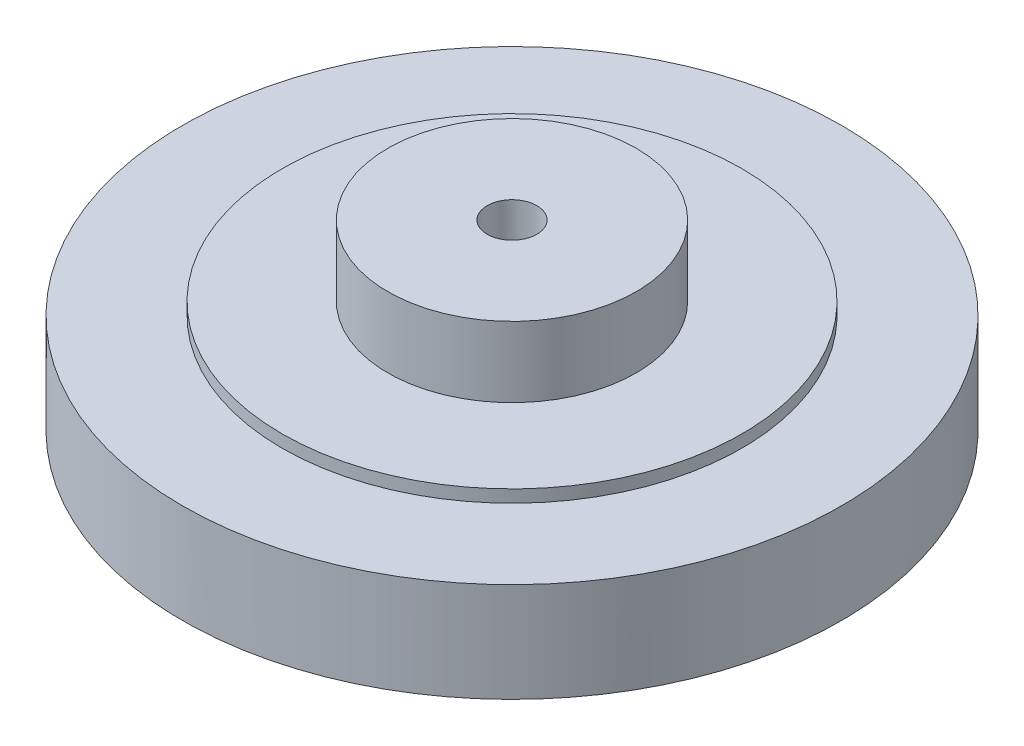
ISO-10303-21;
HEADER;
FILE_DESCRIPTION(('STEP AP214'),'2;1');
FILE_NAME('part.step','',(''),(''),'','','');
FILE_SCHEMA(('AUTOMOTIVE_DESIGN { 1 0 10303 214 1 1 1 1 }'));
ENDSEC;
DATA;
#1=APPLICATION_CONTEXT('core data for automotive mechanical design processes');
#2=APPLICATION_PROTOCOL_DEFINITION('international standard','automotive_design',2000,#1);
#3=PRODUCT_CONTEXT('',#1,'mechanical');
#4=PRODUCT('Part','Part','',(#3));
#5=PRODUCT_RELATED_PRODUCT_CATEGORY('part','',(#4));
#6=PRODUCT_DEFINITION_FORMATION('','',#4);
#7=PRODUCT_DEFINITION_CONTEXT('part definition',#1,'design');
#8=PRODUCT_DEFINITION('design','',#6,#7);
#9=PRODUCT_DEFINITION_SHAPE('','',#8);
#10=(LENGTH_UNIT() NAMED_UNIT(*) SI_UNIT(.MILLI.,.METRE.));
#11=(NAMED_UNIT(*) PLANE_ANGLE_UNIT() SI_UNIT($,.RADIAN.));
#12=(NAMED_UNIT(*) SI_UNIT($,.STERADIAN.) SOLID_ANGLE_UNIT());
#13=UNCERTAINTY_MEASURE_WITH_UNIT(LENGTH_MEASURE(1.E-05),#10,'distance_accuracy_value','');
#14=(GEOMETRIC_REPRESENTATION_CONTEXT(3) GLOBAL_UNCERTAINTY_ASSIGNED_CONTEXT((#13)) GLOBAL_UNIT_ASSIGNED_CONTEXT((#10,
#11,#12)) REPRESENTATION_CONTEXT('',''));
#15=CARTESIAN_POINT('',(0.,0.,0.));
#16=DIRECTION('',(0.,0.,1.));
#17=DIRECTION('',(1.,0.,0.));
#18=AXIS2_PLACEMENT_3D('',#15,#16,#17);
#19=CARTESIAN_POINT('',(0.,0.,0.));
#20=DIRECTION('',(0.,-1.,0.));
#21=DIRECTION('',(0.,0.,-1.));
#22=AXIS2_PLACEMENT_3D('',#19,#20,#21);
#23=CYLINDRICAL_SURFACE('',#22,27.75);
#24=CARTESIAN_POINT('',(0.,0.,0.));
#25=DIRECTION('',(0.,-1.,0.));
#26=DIRECTION('',(0.,0.,-1.));
#27=AXIS2_PLACEMENT_3D('',#24,#25,#26);
#28=CIRCLE('',#27,27.75);
#29=CARTESIAN_POINT('',(0.,0.,-27.75));
#30=VERTEX_POINT('',#29);
#31=EDGE_CURVE('E10',#30,#30,#28,.F.);
#32=ORIENTED_EDGE('',*,*,#31,.F.);
#33=EDGE_LOOP('',(#32));
#34=FACE_BOUND('',#33,.T.);
#35=CARTESIAN_POINT('',(0.,-1.5,0.));
#36=DIRECTION('',(0.,-1.,0.));
#37=DIRECTION('',(0.,0.,-1.));
#38=AXIS2_PLACEMENT_3D('',#35,#36,#37);
#39=CIRCLE('',#38,27.75);
#40=CARTESIAN_POINT('',(0.,-1.5,-27.75));
#41=VERTEX_POINT('',#40);
#42=EDGE_CURVE('E76',#41,#41,#39,.T.);
#43=ORIENTED_EDGE('',*,*,#42,.F.);
#44=EDGE_LOOP('',(#43));
#45=FACE_BOUND('',#44,.T.);
#46=ADVANCED_FACE('F47',(#34,#45),#23,.T.);
#47=CARTESIAN_POINT('',(0.,0.,0.));
#48=DIRECTION('',(0.,-1.,0.));
#49=DIRECTION('',(0.,0.,-1.));
#50=AXIS2_PLACEMENT_3D('',#47,#48,#49);
#51=CYLINDRICAL_SURFACE('',#50,15.);
#52=CARTESIAN_POINT('',(0.,22.,0.));
#53=DIRECTION('',(0.,-1.,0.));
#54=DIRECTION('',(0.,0.,-1.));
#55=AXIS2_PLACEMENT_3D('',#52,#53,#54);
#56=CIRCLE('',#55,15.);
#57=CARTESIAN_POINT('',(0.,22.,-15.));
#58=VERTEX_POINT('',#57);
#59=EDGE_CURVE('E60',#58,#58,#56,.T.);
#60=ORIENTED_EDGE('',*,*,#59,.T.);
#61=EDGE_LOOP('',(#60));
#62=FACE_BOUND('',#61,.T.);
#63=CARTESIAN_POINT('',(0.,13.5,0.));
#64=DIRECTION('',(0.,-1.,0.));
#65=DIRECTION('',(0.,0.,-1.));
#66=AXIS2_PLACEMENT_3D('',#63,#64,#65);
#67=CIRCLE('',#66,15.);
#68=CARTESIAN_POINT('',(0.,13.5,-15.));
#69=VERTEX_POINT('',#68);
#70=EDGE_CURVE('E71',#69,#69,#67,.F.);
#71=ORIENTED_EDGE('',*,*,#70,.T.);
#72=EDGE_LOOP('',(#71));
#73=FACE_BOUND('',#72,.T.);
#74=ADVANCED_FACE('F114',(#62,#73),#51,.T.);
#75=CARTESIAN_POINT('',(3.,22.,0.));
#76=DIRECTION('',(0.,1.,0.));
#77=DIRECTION('',(0.,0.,1.));
#78=AXIS2_PLACEMENT_3D('',#75,#76,#77);
#79=PLANE('',#78);
#80=CARTESIAN_POINT('',(0.,22.,0.));
#81=DIRECTION('',(0.,-1.,0.));
#82=DIRECTION('',(0.,0.,-1.));
#83=AXIS2_PLACEMENT_3D('',#80,#81,#82);
#84=CIRCLE('',#83,3.);
#85=CARTESIAN_POINT('',(0.,22.,-3.));
#86=VERTEX_POINT('',#85);
#87=EDGE_CURVE('E65',#86,#86,#84,.T.);
#88=ORIENTED_EDGE('',*,*,#87,.T.);
#89=EDGE_LOOP('',(#88));
#90=FACE_BOUND('',#89,.T.);
#91=ORIENTED_EDGE('',*,*,#59,.F.);
#92=EDGE_LOOP('',(#91));
#93=FACE_BOUND('',#92,.T.);
#94=ADVANCED_FACE('F49',(#90,#93),#79,.T.);
#95=CARTESIAN_POINT('',(0.,0.,0.));
#96=DIRECTION('',(0.,-1.,0.));
#97=DIRECTION('',(0.,0.,-1.));
#98=AXIS2_PLACEMENT_3D('',#95,#96,#97);
#99=CYLINDRICAL_SURFACE('',#98,3.);
#100=ORIENTED_EDGE('',*,*,#87,.F.);
#101=EDGE_LOOP('',(#100));
#102=FACE_BOUND('',#101,.T.);
#103=CARTESIAN_POINT('',(0.,-1.5,0.));
#104=DIRECTION('',(0.,-1.,0.));
#105=DIRECTION('',(0.,0.,-1.));
#106=AXIS2_PLACEMENT_3D('',#103,#104,#105);
#107=CIRCLE('',#106,3.);
#108=CARTESIAN_POINT('',(0.,-1.5,-3.));
#109=VERTEX_POINT('',#108);
#110=EDGE_CURVE('E80',#109,#109,#107,.T.);
#111=ORIENTED_EDGE('',*,*,#110,.T.);
#112=EDGE_LOOP('',(#111));
#113=FACE_BOUND('',#112,.T.);
#114=ADVANCED_FACE('F133',(#102,#113),#99,.F.);
#115=CARTESIAN_POINT('',(0.,-1.5,0.));
#116=DIRECTION('',(0.,-1.,0.));
#117=DIRECTION('',(0.,0.,-1.));
#118=AXIS2_PLACEMENT_3D('',#115,#116,#117);
#119=PLANE('',#118);
#120=ORIENTED_EDGE('',*,*,#110,.F.);
#121=EDGE_LOOP('',(#120));
#122=FACE_BOUND('',#121,.T.);
#123=ORIENTED_EDGE('',*,*,#42,.T.);
#124=EDGE_LOOP('',(#123));
#125=FACE_BOUND('',#124,.T.);
#126=ADVANCED_FACE('F126',(#122,#125),#119,.T.);
#127=CARTESIAN_POINT('',(0.,12.,0.));
#128=DIRECTION('',(0.,1.,0.));
#129=DIRECTION('',(0.,0.,1.));
#130=AXIS2_PLACEMENT_3D('',#127,#128,#129);
#131=CIRCLE('',#130,27.75);
#132=CARTESIAN_POINT('',(0.,12.,27.75));
#133=VERTEX_POINT('',#132);
#134=EDGE_CURVE('E55',#133,#133,#131,.F.);
#135=ORIENTED_EDGE('',*,*,#134,.F.);
#136=EDGE_LOOP('',(#135));
#137=FACE_BOUND('',#136,.T.);
#138=CARTESIAN_POINT('',(0.,13.5,0.));
#139=DIRECTION('',(0.,-1.,0.));
#140=DIRECTION('',(0.,0.,-1.));
#141=AXIS2_PLACEMENT_3D('',#138,#139,#140);
#142=CIRCLE('',#141,27.75);
#143=CARTESIAN_POINT('',(0.,13.5,-27.75));
#144=VERTEX_POINT('',#143);
#145=EDGE_CURVE('E75',#144,#144,#142,.T.);
#146=ORIENTED_EDGE('',*,*,#145,.T.);
#147=EDGE_LOOP('',(#146));
#148=FACE_BOUND('',#147,.T.);
#149=ADVANCED_FACE('F117',(#137,#148),#23,.T.);
#150=CARTESIAN_POINT('',(0.,13.5,0.));
#151=DIRECTION('',(0.,-1.,0.));
#152=DIRECTION('',(0.,0.,-1.));
#153=AXIS2_PLACEMENT_3D('',#150,#151,#152);
#154=PLANE('',#153);
#155=ORIENTED_EDGE('',*,*,#70,.F.);
#156=EDGE_LOOP('',(#155));
#157=FACE_BOUND('',#156,.T.);
#158=ORIENTED_EDGE('',*,*,#145,.F.);
#159=EDGE_LOOP('',(#158));
#160=FACE_BOUND('',#159,.T.);
#161=ADVANCED_FACE('F101',(#157,#160),#154,.F.);
#162=CARTESIAN_POINT('',(0.,124.539539519638,0.));
#163=DIRECTION('',(0.,-1.,0.));
#164=DIRECTION('',(0.,0.,-1.));
#165=AXIS2_PLACEMENT_3D('',#162,#163,#164);
#166=CYLINDRICAL_SURFACE('',#165,39.7887357729738);
#167=CARTESIAN_POINT('',(0.,0.,0.));
#168=DIRECTION('',(0.,-1.,0.));
#169=DIRECTION('',(0.,0.,-1.));
#170=AXIS2_PLACEMENT_3D('',#167,#168,#169);
#171=CIRCLE('',#170,39.7887357729738);
#172=CARTESIAN_POINT('',(0.,0.,-39.7887357729738));
#173=VERTEX_POINT('',#172);
#174=EDGE_CURVE('E87',#173,#173,#171,.T.);
#175=ORIENTED_EDGE('',*,*,#174,.F.);
#176=EDGE_LOOP('',(#175));
#177=FACE_BOUND('',#176,.T.);
#178=CARTESIAN_POINT('',(0.,12.,0.));
#179=DIRECTION('',(0.,1.,0.));
#180=DIRECTION('',(0.,0.,1.));
#181=AXIS2_PLACEMENT_3D('',#178,#179,#180);
#182=CIRCLE('',#181,39.7887357729738);
#183=CARTESIAN_POINT('',(0.,12.,39.7887357729738));
#184=VERTEX_POINT('',#183);
#185=EDGE_CURVE('E88',#184,#184,#182,.F.);
#186=ORIENTED_EDGE('',*,*,#185,.T.);
#187=EDGE_LOOP('',(#186));
#188=FACE_BOUND('',#187,.T.);
#189=ADVANCED_FACE('F98',(#177,#188),#166,.T.);
#190=CARTESIAN_POINT('',(0.,0.,0.));
#191=DIRECTION('',(0.,-1.,0.));
#192=DIRECTION('',(0.,0.,-1.));
#193=AXIS2_PLACEMENT_3D('',#190,#191,#192);
#194=PLANE('',#193);
#195=ORIENTED_EDGE('',*,*,#31,.T.);
#196=EDGE_LOOP('',(#195));
#197=FACE_BOUND('',#196,.T.);
#198=ORIENTED_EDGE('',*,*,#174,.T.);
#199=EDGE_LOOP('',(#198));
#200=FACE_BOUND('',#199,.T.);
#201=ADVANCED_FACE('F96',(#197,#200),#194,.T.);
#202=CARTESIAN_POINT('',(15.,12.,0.));
#203=DIRECTION('',(0.,1.,0.));
#204=DIRECTION('',(0.,0.,1.));
#205=AXIS2_PLACEMENT_3D('',#202,#203,#204);
#206=PLANE('',#205);
#207=ORIENTED_EDGE('',*,*,#185,.F.);
#208=EDGE_LOOP('',(#207));
#209=FACE_BOUND('',#208,.T.);
#210=ORIENTED_EDGE('',*,*,#134,.T.);
#211=EDGE_LOOP('',(#210));
#212=FACE_BOUND('',#211,.T.);
#213=ADVANCED_FACE('F105',(#209,#212),#206,.T.);
#214=CLOSED_SHELL('',(#46,#74,#94,#114,#126,#149,#161,#189,#201,#213));
#215=MANIFOLD_SOLID_BREP('B2',#214);
#216=ADVANCED_BREP_SHAPE_REPRESENTATION('',(#18,#215),#14);
#217=SHAPE_DEFINITION_REPRESENTATION(#9,#216);
ENDSEC;
END-ISO-10303-21;
